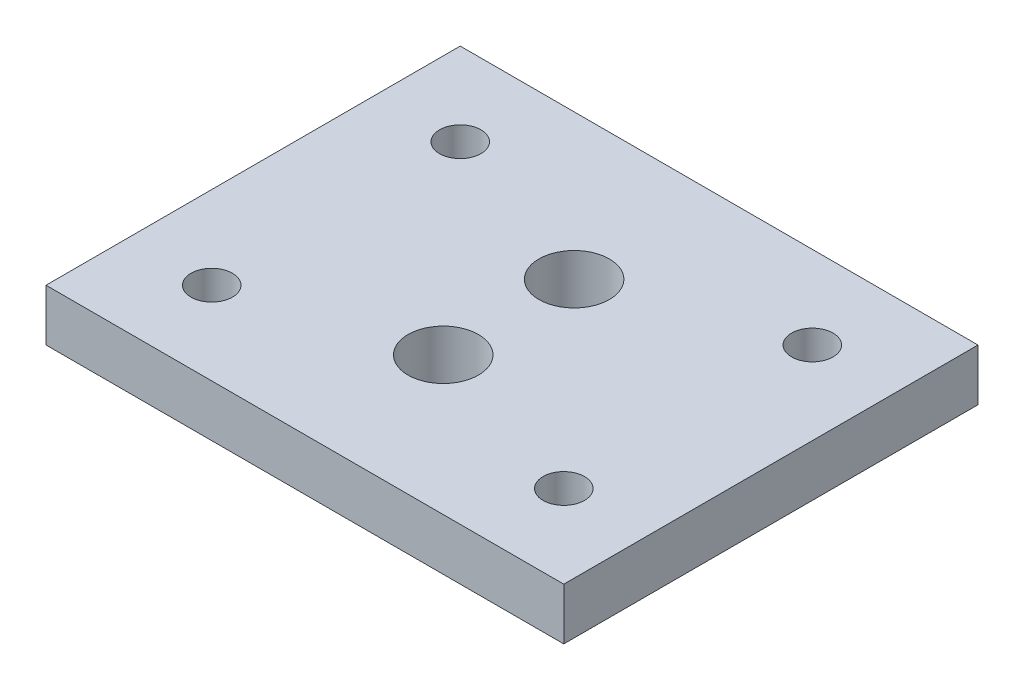
ISO-10303-21;
HEADER;
FILE_DESCRIPTION(('STEP AP214'),'2;1');
FILE_NAME('part.step','',(''),(''),'','','');
FILE_SCHEMA(('AUTOMOTIVE_DESIGN { 1 0 10303 214 1 1 1 1 }'));
ENDSEC;
DATA;
#1=APPLICATION_CONTEXT('core data for automotive mechanical design processes');
#2=APPLICATION_PROTOCOL_DEFINITION('international standard','automotive_design',2000,#1);
#3=PRODUCT_CONTEXT('',#1,'mechanical');
#4=PRODUCT('Part','Part','',(#3));
#5=PRODUCT_RELATED_PRODUCT_CATEGORY('part','',(#4));
#6=PRODUCT_DEFINITION_FORMATION('','',#4);
#7=PRODUCT_DEFINITION_CONTEXT('part definition',#1,'design');
#8=PRODUCT_DEFINITION('design','',#6,#7);
#9=PRODUCT_DEFINITION_SHAPE('','',#8);
#10=(LENGTH_UNIT() NAMED_UNIT(*) SI_UNIT(.MILLI.,.METRE.));
#11=(NAMED_UNIT(*) PLANE_ANGLE_UNIT() SI_UNIT($,.RADIAN.));
#12=(NAMED_UNIT(*) SI_UNIT($,.STERADIAN.) SOLID_ANGLE_UNIT());
#13=UNCERTAINTY_MEASURE_WITH_UNIT(LENGTH_MEASURE(1.E-05),#10,'distance_accuracy_value','');
#14=(GEOMETRIC_REPRESENTATION_CONTEXT(3) GLOBAL_UNCERTAINTY_ASSIGNED_CONTEXT((#13)) GLOBAL_UNIT_ASSIGNED_CONTEXT((#10,
#11,#12)) REPRESENTATION_CONTEXT('',''));
#15=CARTESIAN_POINT('',(0.,0.,0.));
#16=DIRECTION('',(0.,0.,1.));
#17=DIRECTION('',(1.,0.,0.));
#18=AXIS2_PLACEMENT_3D('',#15,#16,#17);
#19=CARTESIAN_POINT('',(0.,3.175,0.));
#20=DIRECTION('',(0.,0.,-1.));
#21=DIRECTION('',(-1.,0.,0.));
#22=AXIS2_PLACEMENT_3D('',#19,#20,#21);
#23=PLANE('',#22);
#24=DIRECTION('',(1.,0.,0.));
#25=VECTOR('',#24,1.);
#26=CARTESIAN_POINT('',(0.,0.,0.));
#27=LINE('',#26,#25);
#28=CARTESIAN_POINT('',(-31.75,0.,0.));
#29=VERTEX_POINT('',#28);
#30=CARTESIAN_POINT('',(0.,0.,0.));
#31=VERTEX_POINT('',#30);
#32=EDGE_CURVE('E120',#29,#31,#27,.T.);
#33=ORIENTED_EDGE('',*,*,#32,.T.);
#34=DIRECTION('',(0.,-1.,0.));
#35=VECTOR('',#34,1.);
#36=CARTESIAN_POINT('',(0.,3.175,0.));
#37=LINE('',#36,#35);
#38=CARTESIAN_POINT('',(0.,3.175,0.));
#39=VERTEX_POINT('',#38);
#40=EDGE_CURVE('E11',#39,#31,#37,.T.);
#41=ORIENTED_EDGE('',*,*,#40,.F.);
#42=DIRECTION('',(1.,0.,0.));
#43=VECTOR('',#42,1.);
#44=CARTESIAN_POINT('',(0.,3.175,0.));
#45=LINE('',#44,#43);
#46=CARTESIAN_POINT('',(-31.75,3.175,0.));
#47=VERTEX_POINT('',#46);
#48=EDGE_CURVE('E95',#47,#39,#45,.T.);
#49=ORIENTED_EDGE('',*,*,#48,.F.);
#50=DIRECTION('',(0.,-1.,0.));
#51=VECTOR('',#50,1.);
#52=CARTESIAN_POINT('',(-31.75,3.175,0.));
#53=LINE('',#52,#51);
#54=EDGE_CURVE('E103',#47,#29,#53,.T.);
#55=ORIENTED_EDGE('',*,*,#54,.T.);
#56=EDGE_LOOP('',(#33,#41,#49,#55));
#57=FACE_BOUND('',#56,.T.);
#58=ADVANCED_FACE('F43',(#57),#23,.F.);
#59=CARTESIAN_POINT('',(0.,3.175,0.));
#60=DIRECTION('',(-1.,0.,0.));
#61=DIRECTION('',(0.,0.,1.));
#62=AXIS2_PLACEMENT_3D('',#59,#60,#61);
#63=PLANE('',#62);
#64=DIRECTION('',(0.,0.,-1.));
#65=VECTOR('',#64,1.);
#66=CARTESIAN_POINT('',(0.,0.,0.));
#67=LINE('',#66,#65);
#68=CARTESIAN_POINT('',(0.,0.,-25.4));
#69=VERTEX_POINT('',#68);
#70=EDGE_CURVE('E99',#31,#69,#67,.T.);
#71=ORIENTED_EDGE('',*,*,#70,.T.);
#72=DIRECTION('',(0.,-1.,0.));
#73=VECTOR('',#72,1.);
#74=CARTESIAN_POINT('',(0.,3.175,-25.4));
#75=LINE('',#74,#73);
#76=CARTESIAN_POINT('',(0.,3.175,-25.4));
#77=VERTEX_POINT('',#76);
#78=EDGE_CURVE('E52',#77,#69,#75,.T.);
#79=ORIENTED_EDGE('',*,*,#78,.F.);
#80=DIRECTION('',(0.,0.,-1.));
#81=VECTOR('',#80,1.);
#82=CARTESIAN_POINT('',(0.,3.175,0.));
#83=LINE('',#82,#81);
#84=EDGE_CURVE('E90',#39,#77,#83,.T.);
#85=ORIENTED_EDGE('',*,*,#84,.F.);
#86=ORIENTED_EDGE('',*,*,#40,.T.);
#87=EDGE_LOOP('',(#71,#79,#85,#86));
#88=FACE_BOUND('',#87,.T.);
#89=ADVANCED_FACE('F98',(#88),#63,.F.);
#90=CARTESIAN_POINT('',(0.,3.175,-25.4));
#91=DIRECTION('',(0.,0.,1.));
#92=DIRECTION('',(1.,0.,0.));
#93=AXIS2_PLACEMENT_3D('',#90,#91,#92);
#94=PLANE('',#93);
#95=DIRECTION('',(-1.,0.,0.));
#96=VECTOR('',#95,1.);
#97=CARTESIAN_POINT('',(0.,0.,-25.4));
#98=LINE('',#97,#96);
#99=CARTESIAN_POINT('',(-31.75,0.,-25.4));
#100=VERTEX_POINT('',#99);
#101=EDGE_CURVE('E77',#69,#100,#98,.T.);
#102=ORIENTED_EDGE('',*,*,#101,.T.);
#103=DIRECTION('',(0.,-1.,0.));
#104=VECTOR('',#103,1.);
#105=CARTESIAN_POINT('',(-31.75,3.175,-25.4));
#106=LINE('',#105,#104);
#107=CARTESIAN_POINT('',(-31.75,3.175,-25.4));
#108=VERTEX_POINT('',#107);
#109=EDGE_CURVE('E100',#108,#100,#106,.T.);
#110=ORIENTED_EDGE('',*,*,#109,.F.);
#111=DIRECTION('',(-1.,0.,0.));
#112=VECTOR('',#111,1.);
#113=CARTESIAN_POINT('',(0.,3.175,-25.4));
#114=LINE('',#113,#112);
#115=EDGE_CURVE('E93',#77,#108,#114,.T.);
#116=ORIENTED_EDGE('',*,*,#115,.F.);
#117=ORIENTED_EDGE('',*,*,#78,.T.);
#118=EDGE_LOOP('',(#102,#110,#116,#117));
#119=FACE_BOUND('',#118,.T.);
#120=ADVANCED_FACE('F101',(#119),#94,.F.);
#121=CARTESIAN_POINT('',(-5.08,3.175,-5.08));
#122=DIRECTION('',(0.,-1.,0.));
#123=DIRECTION('',(0.,0.,-1.));
#124=AXIS2_PLACEMENT_3D('',#121,#122,#123);
#125=CYLINDRICAL_SURFACE('',#124,1.27);
#126=CARTESIAN_POINT('',(-5.08,3.175,-5.08));
#127=DIRECTION('',(0.,1.,0.));
#128=DIRECTION('',(0.,0.,1.));
#129=AXIS2_PLACEMENT_3D('',#126,#127,#128);
#130=CIRCLE('',#129,1.27);
#131=CARTESIAN_POINT('',(-5.08,3.175,-3.81));
#132=VERTEX_POINT('',#131);
#133=EDGE_CURVE('E133',#132,#132,#130,.T.);
#134=ORIENTED_EDGE('',*,*,#133,.T.);
#135=EDGE_LOOP('',(#134));
#136=FACE_BOUND('',#135,.T.);
#137=CARTESIAN_POINT('',(-5.08,0.,-5.08));
#138=DIRECTION('',(0.,1.,0.));
#139=DIRECTION('',(0.,0.,1.));
#140=AXIS2_PLACEMENT_3D('',#137,#138,#139);
#141=CIRCLE('',#140,1.27);
#142=CARTESIAN_POINT('',(-5.08,0.,-3.81));
#143=VERTEX_POINT('',#142);
#144=EDGE_CURVE('E117',#143,#143,#141,.T.);
#145=ORIENTED_EDGE('',*,*,#144,.F.);
#146=EDGE_LOOP('',(#145));
#147=FACE_BOUND('',#146,.T.);
#148=ADVANCED_FACE('F179',(#136,#147),#125,.F.);
#149=CARTESIAN_POINT('',(-5.08,3.175,-20.32));
#150=DIRECTION('',(0.,-1.,0.));
#151=DIRECTION('',(0.,0.,-1.));
#152=AXIS2_PLACEMENT_3D('',#149,#150,#151);
#153=CYLINDRICAL_SURFACE('',#152,1.27);
#154=CARTESIAN_POINT('',(-5.08,3.175,-20.32));
#155=DIRECTION('',(0.,1.,0.));
#156=DIRECTION('',(0.,0.,1.));
#157=AXIS2_PLACEMENT_3D('',#154,#155,#156);
#158=CIRCLE('',#157,1.27);
#159=CARTESIAN_POINT('',(-5.08,3.175,-19.05));
#160=VERTEX_POINT('',#159);
#161=EDGE_CURVE('E135',#160,#160,#158,.T.);
#162=ORIENTED_EDGE('',*,*,#161,.T.);
#163=EDGE_LOOP('',(#162));
#164=FACE_BOUND('',#163,.T.);
#165=CARTESIAN_POINT('',(-5.08,0.,-20.32));
#166=DIRECTION('',(0.,1.,0.));
#167=DIRECTION('',(0.,0.,1.));
#168=AXIS2_PLACEMENT_3D('',#165,#166,#167);
#169=CIRCLE('',#168,1.27);
#170=CARTESIAN_POINT('',(-5.08,0.,-19.05));
#171=VERTEX_POINT('',#170);
#172=EDGE_CURVE('E114',#171,#171,#169,.T.);
#173=ORIENTED_EDGE('',*,*,#172,.F.);
#174=EDGE_LOOP('',(#173));
#175=FACE_BOUND('',#174,.T.);
#176=ADVANCED_FACE('F182',(#164,#175),#153,.F.);
#177=CARTESIAN_POINT('',(-26.67,3.175,-20.32));
#178=DIRECTION('',(0.,-1.,0.));
#179=DIRECTION('',(0.,0.,-1.));
#180=AXIS2_PLACEMENT_3D('',#177,#178,#179);
#181=CYLINDRICAL_SURFACE('',#180,1.27);
#182=CARTESIAN_POINT('',(-26.67,3.175,-20.32));
#183=DIRECTION('',(0.,1.,0.));
#184=DIRECTION('',(0.,0.,1.));
#185=AXIS2_PLACEMENT_3D('',#182,#183,#184);
#186=CIRCLE('',#185,1.27);
#187=CARTESIAN_POINT('',(-26.67,3.175,-19.05));
#188=VERTEX_POINT('',#187);
#189=EDGE_CURVE('E140',#188,#188,#186,.T.);
#190=ORIENTED_EDGE('',*,*,#189,.T.);
#191=EDGE_LOOP('',(#190));
#192=FACE_BOUND('',#191,.T.);
#193=CARTESIAN_POINT('',(-26.67,0.,-20.32));
#194=DIRECTION('',(0.,1.,0.));
#195=DIRECTION('',(0.,0.,1.));
#196=AXIS2_PLACEMENT_3D('',#193,#194,#195);
#197=CIRCLE('',#196,1.27);
#198=CARTESIAN_POINT('',(-26.67,0.,-19.05));
#199=VERTEX_POINT('',#198);
#200=EDGE_CURVE('E110',#199,#199,#197,.T.);
#201=ORIENTED_EDGE('',*,*,#200,.F.);
#202=EDGE_LOOP('',(#201));
#203=FACE_BOUND('',#202,.T.);
#204=ADVANCED_FACE('F203',(#192,#203),#181,.F.);
#205=CARTESIAN_POINT('',(-26.67,3.175,-5.08));
#206=DIRECTION('',(0.,-1.,0.));
#207=DIRECTION('',(0.,0.,-1.));
#208=AXIS2_PLACEMENT_3D('',#205,#206,#207);
#209=CYLINDRICAL_SURFACE('',#208,1.27);
#210=CARTESIAN_POINT('',(-26.67,3.175,-5.08));
#211=DIRECTION('',(0.,1.,0.));
#212=DIRECTION('',(0.,0.,1.));
#213=AXIS2_PLACEMENT_3D('',#210,#211,#212);
#214=CIRCLE('',#213,1.27);
#215=CARTESIAN_POINT('',(-26.67,3.175,-3.81));
#216=VERTEX_POINT('',#215);
#217=EDGE_CURVE('E126',#216,#216,#214,.T.);
#218=ORIENTED_EDGE('',*,*,#217,.T.);
#219=EDGE_LOOP('',(#218));
#220=FACE_BOUND('',#219,.T.);
#221=CARTESIAN_POINT('',(-26.67,0.,-5.08));
#222=DIRECTION('',(0.,1.,0.));
#223=DIRECTION('',(0.,0.,1.));
#224=AXIS2_PLACEMENT_3D('',#221,#222,#223);
#225=CIRCLE('',#224,1.27);
#226=CARTESIAN_POINT('',(-26.67,0.,-3.81));
#227=VERTEX_POINT('',#226);
#228=EDGE_CURVE('E107',#227,#227,#225,.T.);
#229=ORIENTED_EDGE('',*,*,#228,.F.);
#230=EDGE_LOOP('',(#229));
#231=FACE_BOUND('',#230,.T.);
#232=ADVANCED_FACE('F45',(#220,#231),#209,.F.);
#233=CARTESIAN_POINT('',(-31.75,3.175,0.));
#234=DIRECTION('',(1.,0.,0.));
#235=DIRECTION('',(0.,0.,-1.));
#236=AXIS2_PLACEMENT_3D('',#233,#234,#235);
#237=PLANE('',#236);
#238=DIRECTION('',(0.,0.,1.));
#239=VECTOR('',#238,1.);
#240=CARTESIAN_POINT('',(-31.75,0.,0.));
#241=LINE('',#240,#239);
#242=EDGE_CURVE('E83',#100,#29,#241,.T.);
#243=ORIENTED_EDGE('',*,*,#242,.T.);
#244=ORIENTED_EDGE('',*,*,#54,.F.);
#245=DIRECTION('',(0.,0.,1.));
#246=VECTOR('',#245,1.);
#247=CARTESIAN_POINT('',(-31.75,3.175,0.));
#248=LINE('',#247,#246);
#249=EDGE_CURVE('E60',#108,#47,#248,.T.);
#250=ORIENTED_EDGE('',*,*,#249,.F.);
#251=ORIENTED_EDGE('',*,*,#109,.T.);
#252=EDGE_LOOP('',(#243,#244,#250,#251));
#253=FACE_BOUND('',#252,.T.);
#254=ADVANCED_FACE('F128',(#253),#237,.F.);
#255=CARTESIAN_POINT('',(0.,3.175,0.));
#256=DIRECTION('',(0.,1.,0.));
#257=DIRECTION('',(0.,0.,1.));
#258=AXIS2_PLACEMENT_3D('',#255,#256,#257);
#259=PLANE('',#258);
#260=CARTESIAN_POINT('',(-15.875,3.175,-8.4836));
#261=DIRECTION('',(0.,1.,0.));
#262=DIRECTION('',(0.,0.,1.));
#263=AXIS2_PLACEMENT_3D('',#260,#261,#262);
#264=CIRCLE('',#263,2.159);
#265=CARTESIAN_POINT('',(-15.875,3.175,-6.3246));
#266=VERTEX_POINT('',#265);
#267=EDGE_CURVE('E151',#266,#266,#264,.T.);
#268=ORIENTED_EDGE('',*,*,#267,.F.);
#269=EDGE_LOOP('',(#268));
#270=FACE_BOUND('',#269,.T.);
#271=CARTESIAN_POINT('',(-15.875,3.175,-16.51));
#272=DIRECTION('',(0.,1.,0.));
#273=DIRECTION('',(0.,0.,1.));
#274=AXIS2_PLACEMENT_3D('',#271,#272,#273);
#275=CIRCLE('',#274,2.159);
#276=CARTESIAN_POINT('',(-15.875,3.175,-14.351));
#277=VERTEX_POINT('',#276);
#278=EDGE_CURVE('E148',#277,#277,#275,.T.);
#279=ORIENTED_EDGE('',*,*,#278,.F.);
#280=EDGE_LOOP('',(#279));
#281=FACE_BOUND('',#280,.T.);
#282=ORIENTED_EDGE('',*,*,#217,.F.);
#283=EDGE_LOOP('',(#282));
#284=FACE_BOUND('',#283,.T.);
#285=ORIENTED_EDGE('',*,*,#189,.F.);
#286=EDGE_LOOP('',(#285));
#287=FACE_BOUND('',#286,.T.);
#288=ORIENTED_EDGE('',*,*,#161,.F.);
#289=EDGE_LOOP('',(#288));
#290=FACE_BOUND('',#289,.T.);
#291=ORIENTED_EDGE('',*,*,#133,.F.);
#292=EDGE_LOOP('',(#291));
#293=FACE_BOUND('',#292,.T.);
#294=ORIENTED_EDGE('',*,*,#48,.T.);
#295=ORIENTED_EDGE('',*,*,#84,.T.);
#296=ORIENTED_EDGE('',*,*,#115,.T.);
#297=ORIENTED_EDGE('',*,*,#249,.T.);
#298=EDGE_LOOP('',(#294,#295,#296,#297));
#299=FACE_BOUND('',#298,.T.);
#300=ADVANCED_FACE('F91',(#270,#281,#284,#287,#290,#293,#299),#259,.T.);
#301=CARTESIAN_POINT('',(0.,0.,0.));
#302=DIRECTION('',(0.,1.,0.));
#303=DIRECTION('',(0.,0.,1.));
#304=AXIS2_PLACEMENT_3D('',#301,#302,#303);
#305=PLANE('',#304);
#306=CARTESIAN_POINT('',(-15.875,0.,-8.4836));
#307=DIRECTION('',(0.,1.,0.));
#308=DIRECTION('',(0.,0.,1.));
#309=AXIS2_PLACEMENT_3D('',#306,#307,#308);
#310=CIRCLE('',#309,2.159);
#311=CARTESIAN_POINT('',(-15.875,0.,-6.3246));
#312=VERTEX_POINT('',#311);
#313=EDGE_CURVE('E111',#312,#312,#310,.T.);
#314=ORIENTED_EDGE('',*,*,#313,.T.);
#315=EDGE_LOOP('',(#314));
#316=FACE_BOUND('',#315,.T.);
#317=CARTESIAN_POINT('',(-15.875,0.,-16.51));
#318=DIRECTION('',(0.,1.,0.));
#319=DIRECTION('',(0.,0.,1.));
#320=AXIS2_PLACEMENT_3D('',#317,#318,#319);
#321=CIRCLE('',#320,2.159);
#322=CARTESIAN_POINT('',(-15.875,0.,-14.351));
#323=VERTEX_POINT('',#322);
#324=EDGE_CURVE('E145',#323,#323,#321,.T.);
#325=ORIENTED_EDGE('',*,*,#324,.T.);
#326=EDGE_LOOP('',(#325));
#327=FACE_BOUND('',#326,.T.);
#328=ORIENTED_EDGE('',*,*,#228,.T.);
#329=EDGE_LOOP('',(#328));
#330=FACE_BOUND('',#329,.T.);
#331=ORIENTED_EDGE('',*,*,#200,.T.);
#332=EDGE_LOOP('',(#331));
#333=FACE_BOUND('',#332,.T.);
#334=ORIENTED_EDGE('',*,*,#172,.T.);
#335=EDGE_LOOP('',(#334));
#336=FACE_BOUND('',#335,.T.);
#337=ORIENTED_EDGE('',*,*,#144,.T.);
#338=EDGE_LOOP('',(#337));
#339=FACE_BOUND('',#338,.T.);
#340=ORIENTED_EDGE('',*,*,#32,.F.);
#341=ORIENTED_EDGE('',*,*,#242,.F.);
#342=ORIENTED_EDGE('',*,*,#101,.F.);
#343=ORIENTED_EDGE('',*,*,#70,.F.);
#344=EDGE_LOOP('',(#340,#341,#342,#343));
#345=FACE_BOUND('',#344,.T.);
#346=ADVANCED_FACE('F131',(#316,#327,#330,#333,#336,#339,#345),#305,.F.);
#347=CARTESIAN_POINT('',(-15.875,0.,-16.51));
#348=DIRECTION('',(0.,1.,0.));
#349=DIRECTION('',(0.,0.,1.));
#350=AXIS2_PLACEMENT_3D('',#347,#348,#349);
#351=CYLINDRICAL_SURFACE('',#350,2.159);
#352=ORIENTED_EDGE('',*,*,#324,.F.);
#353=EDGE_LOOP('',(#352));
#354=FACE_BOUND('',#353,.T.);
#355=ORIENTED_EDGE('',*,*,#278,.T.);
#356=EDGE_LOOP('',(#355));
#357=FACE_BOUND('',#356,.T.);
#358=ADVANCED_FACE('F162',(#354,#357),#351,.F.);
#359=CARTESIAN_POINT('',(-15.875,0.,-8.4836));
#360=DIRECTION('',(0.,1.,0.));
#361=DIRECTION('',(0.,0.,1.));
#362=AXIS2_PLACEMENT_3D('',#359,#360,#361);
#363=CYLINDRICAL_SURFACE('',#362,2.159);
#364=ORIENTED_EDGE('',*,*,#313,.F.);
#365=EDGE_LOOP('',(#364));
#366=FACE_BOUND('',#365,.T.);
#367=ORIENTED_EDGE('',*,*,#267,.T.);
#368=EDGE_LOOP('',(#367));
#369=FACE_BOUND('',#368,.T.);
#370=ADVANCED_FACE('F159',(#366,#369),#363,.F.);
#371=CLOSED_SHELL('',(#58,#89,#120,#148,#176,#204,#232,#254,#300,#346,#358,#370));
#372=MANIFOLD_SOLID_BREP('B2',#371);
#373=ADVANCED_BREP_SHAPE_REPRESENTATION('',(#18,#372),#14);
#374=SHAPE_DEFINITION_REPRESENTATION(#9,#373);
ENDSEC;
END-ISO-10303-21;
